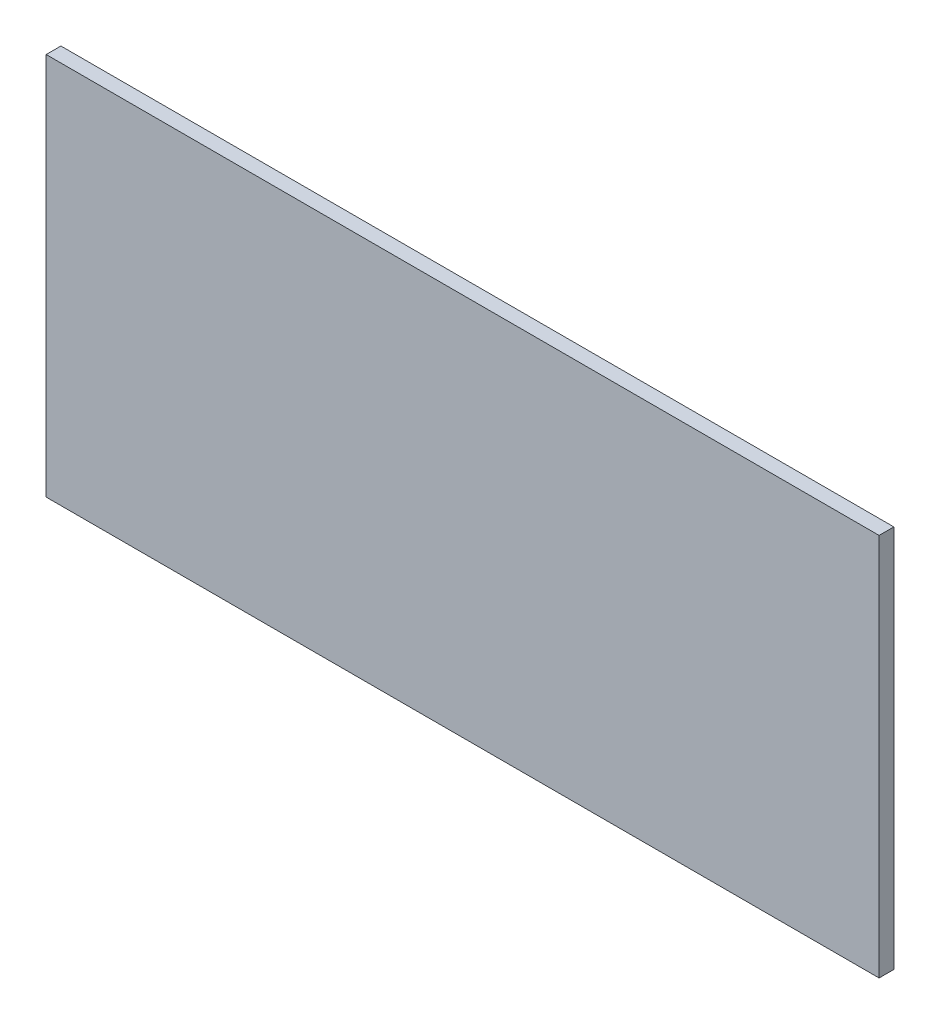
ISO-10303-21;
HEADER;
FILE_DESCRIPTION(('STEP AP214'),'2;1');
FILE_NAME('part.step','',(''),(''),'','','');
FILE_SCHEMA(('AUTOMOTIVE_DESIGN { 1 0 10303 214 1 1 1 1 }'));
ENDSEC;
DATA;
#1=APPLICATION_CONTEXT('core data for automotive mechanical design processes');
#2=APPLICATION_PROTOCOL_DEFINITION('international standard','automotive_design',2000,#1);
#3=PRODUCT_CONTEXT('',#1,'mechanical');
#4=PRODUCT('Part','Part','',(#3));
#5=PRODUCT_RELATED_PRODUCT_CATEGORY('part','',(#4));
#6=PRODUCT_DEFINITION_FORMATION('','',#4);
#7=PRODUCT_DEFINITION_CONTEXT('part definition',#1,'design');
#8=PRODUCT_DEFINITION('design','',#6,#7);
#9=PRODUCT_DEFINITION_SHAPE('','',#8);
#10=(LENGTH_UNIT() NAMED_UNIT(*) SI_UNIT(.MILLI.,.METRE.));
#11=(NAMED_UNIT(*) PLANE_ANGLE_UNIT() SI_UNIT($,.RADIAN.));
#12=(NAMED_UNIT(*) SI_UNIT($,.STERADIAN.) SOLID_ANGLE_UNIT());
#13=UNCERTAINTY_MEASURE_WITH_UNIT(LENGTH_MEASURE(1.E-05),#10,'distance_accuracy_value','');
#14=(GEOMETRIC_REPRESENTATION_CONTEXT(3) GLOBAL_UNCERTAINTY_ASSIGNED_CONTEXT((#13)) GLOBAL_UNIT_ASSIGNED_CONTEXT((#10,
#11,#12)) REPRESENTATION_CONTEXT('',''));
#15=CARTESIAN_POINT('',(0.,0.,0.));
#16=DIRECTION('',(0.,0.,1.));
#17=DIRECTION('',(1.,0.,0.));
#18=AXIS2_PLACEMENT_3D('',#15,#16,#17);
#19=CARTESIAN_POINT('',(-2.825,-1.3,0.1));
#20=DIRECTION('',(0.,0.,-1.));
#21=DIRECTION('',(-1.,0.,0.));
#22=AXIS2_PLACEMENT_3D('',#19,#20,#21);
#23=PLANE('',#22);
#24=DIRECTION('',(0.,1.,0.));
#25=VECTOR('',#24,1.);
#26=CARTESIAN_POINT('',(2.825,-1.3,0.1));
#27=LINE('',#26,#25);
#28=CARTESIAN_POINT('',(2.825,-1.3,0.1));
#29=VERTEX_POINT('',#28);
#30=CARTESIAN_POINT('',(2.825,1.3,0.1));
#31=VERTEX_POINT('',#30);
#32=EDGE_CURVE('E55',#29,#31,#27,.T.);
#33=ORIENTED_EDGE('',*,*,#32,.T.);
#34=DIRECTION('',(1.,0.,0.));
#35=VECTOR('',#34,1.);
#36=CARTESIAN_POINT('',(2.825,1.3,0.1));
#37=LINE('',#36,#35);
#38=CARTESIAN_POINT('',(-2.825,1.3,0.1));
#39=VERTEX_POINT('',#38);
#40=EDGE_CURVE('E57',#31,#39,#37,.F.);
#41=ORIENTED_EDGE('',*,*,#40,.T.);
#42=DIRECTION('',(0.,1.,0.));
#43=VECTOR('',#42,1.);
#44=CARTESIAN_POINT('',(-2.825,1.3,0.1));
#45=LINE('',#44,#43);
#46=CARTESIAN_POINT('',(-2.825,-1.3,0.1));
#47=VERTEX_POINT('',#46);
#48=EDGE_CURVE('E20',#39,#47,#45,.F.);
#49=ORIENTED_EDGE('',*,*,#48,.T.);
#50=DIRECTION('',(1.,0.,0.));
#51=VECTOR('',#50,1.);
#52=CARTESIAN_POINT('',(-2.825,-1.3,0.1));
#53=LINE('',#52,#51);
#54=EDGE_CURVE('E80',#47,#29,#53,.T.);
#55=ORIENTED_EDGE('',*,*,#54,.T.);
#56=EDGE_LOOP('',(#33,#41,#49,#55));
#57=FACE_BOUND('',#56,.T.);
#58=ADVANCED_FACE('F17',(#57),#23,.F.);
#59=CARTESIAN_POINT('',(-2.825,1.3,0.));
#60=DIRECTION('',(1.,0.,0.));
#61=DIRECTION('',(0.,0.,-1.));
#62=AXIS2_PLACEMENT_3D('',#59,#60,#61);
#63=PLANE('',#62);
#64=DIRECTION('',(0.,0.,1.));
#65=VECTOR('',#64,1.);
#66=CARTESIAN_POINT('',(-2.825,-1.3,0.));
#67=LINE('',#66,#65);
#68=CARTESIAN_POINT('',(-2.825,-1.3,0.));
#69=VERTEX_POINT('',#68);
#70=EDGE_CURVE('E68',#69,#47,#67,.T.);
#71=ORIENTED_EDGE('',*,*,#70,.T.);
#72=ORIENTED_EDGE('',*,*,#48,.F.);
#73=DIRECTION('',(0.,0.,-1.));
#74=VECTOR('',#73,1.);
#75=CARTESIAN_POINT('',(-2.825,1.3,0.));
#76=LINE('',#75,#74);
#77=CARTESIAN_POINT('',(-2.825,1.3,0.));
#78=VERTEX_POINT('',#77);
#79=EDGE_CURVE('E63',#39,#78,#76,.T.);
#80=ORIENTED_EDGE('',*,*,#79,.T.);
#81=DIRECTION('',(0.,1.,0.));
#82=VECTOR('',#81,1.);
#83=CARTESIAN_POINT('',(-2.825,-1.3,0.));
#84=LINE('',#83,#82);
#85=EDGE_CURVE('E83',#69,#78,#84,.T.);
#86=ORIENTED_EDGE('',*,*,#85,.F.);
#87=EDGE_LOOP('',(#71,#72,#80,#86));
#88=FACE_BOUND('',#87,.T.);
#89=ADVANCED_FACE('F65',(#88),#63,.F.);
#90=CARTESIAN_POINT('',(2.825,1.3,0.));
#91=DIRECTION('',(0.,-1.,0.));
#92=DIRECTION('',(0.,0.,-1.));
#93=AXIS2_PLACEMENT_3D('',#90,#91,#92);
#94=PLANE('',#93);
#95=ORIENTED_EDGE('',*,*,#79,.F.);
#96=ORIENTED_EDGE('',*,*,#40,.F.);
#97=DIRECTION('',(0.,0.,1.));
#98=VECTOR('',#97,1.);
#99=CARTESIAN_POINT('',(2.825,1.3,0.));
#100=LINE('',#99,#98);
#101=CARTESIAN_POINT('',(2.825,1.3,0.));
#102=VERTEX_POINT('',#101);
#103=EDGE_CURVE('E75',#31,#102,#100,.F.);
#104=ORIENTED_EDGE('',*,*,#103,.T.);
#105=DIRECTION('',(-1.,0.,0.));
#106=VECTOR('',#105,1.);
#107=CARTESIAN_POINT('',(-2.825,1.3,0.));
#108=LINE('',#107,#106);
#109=EDGE_CURVE('E72',#78,#102,#108,.F.);
#110=ORIENTED_EDGE('',*,*,#109,.F.);
#111=EDGE_LOOP('',(#95,#96,#104,#110));
#112=FACE_BOUND('',#111,.T.);
#113=ADVANCED_FACE('F70',(#112),#94,.F.);
#114=CARTESIAN_POINT('',(2.825,-1.3,0.));
#115=DIRECTION('',(-1.,0.,0.));
#116=DIRECTION('',(0.,0.,1.));
#117=AXIS2_PLACEMENT_3D('',#114,#115,#116);
#118=PLANE('',#117);
#119=ORIENTED_EDGE('',*,*,#103,.F.);
#120=ORIENTED_EDGE('',*,*,#32,.F.);
#121=DIRECTION('',(0.,0.,1.));
#122=VECTOR('',#121,1.);
#123=CARTESIAN_POINT('',(2.825,-1.3,0.));
#124=LINE('',#123,#122);
#125=CARTESIAN_POINT('',(2.825,-1.3,0.));
#126=VERTEX_POINT('',#125);
#127=EDGE_CURVE('E35',#29,#126,#124,.F.);
#128=ORIENTED_EDGE('',*,*,#127,.T.);
#129=DIRECTION('',(0.,1.,0.));
#130=VECTOR('',#129,1.);
#131=CARTESIAN_POINT('',(2.825,-1.3,0.));
#132=LINE('',#131,#130);
#133=EDGE_CURVE('E26',#102,#126,#132,.F.);
#134=ORIENTED_EDGE('',*,*,#133,.F.);
#135=EDGE_LOOP('',(#119,#120,#128,#134));
#136=FACE_BOUND('',#135,.T.);
#137=ADVANCED_FACE('F89',(#136),#118,.F.);
#138=CARTESIAN_POINT('',(-2.825,-1.3,0.));
#139=DIRECTION('',(0.,1.,0.));
#140=DIRECTION('',(0.,0.,1.));
#141=AXIS2_PLACEMENT_3D('',#138,#139,#140);
#142=PLANE('',#141);
#143=ORIENTED_EDGE('',*,*,#127,.F.);
#144=ORIENTED_EDGE('',*,*,#54,.F.);
#145=ORIENTED_EDGE('',*,*,#70,.F.);
#146=DIRECTION('',(-1.,0.,0.));
#147=VECTOR('',#146,1.);
#148=CARTESIAN_POINT('',(-2.825,-1.3,0.));
#149=LINE('',#148,#147);
#150=EDGE_CURVE('E11',#126,#69,#149,.T.);
#151=ORIENTED_EDGE('',*,*,#150,.F.);
#152=EDGE_LOOP('',(#143,#144,#145,#151));
#153=FACE_BOUND('',#152,.T.);
#154=ADVANCED_FACE('F91',(#153),#142,.F.);
#155=CARTESIAN_POINT('',(-2.825,-1.3,0.));
#156=DIRECTION('',(0.,0.,-1.));
#157=DIRECTION('',(-1.,0.,0.));
#158=AXIS2_PLACEMENT_3D('',#155,#156,#157);
#159=PLANE('',#158);
#160=ORIENTED_EDGE('',*,*,#133,.T.);
#161=ORIENTED_EDGE('',*,*,#150,.T.);
#162=ORIENTED_EDGE('',*,*,#85,.T.);
#163=ORIENTED_EDGE('',*,*,#109,.T.);
#164=EDGE_LOOP('',(#160,#161,#162,#163));
#165=FACE_BOUND('',#164,.T.);
#166=ADVANCED_FACE('F88',(#165),#159,.T.);
#167=CLOSED_SHELL('',(#58,#89,#113,#137,#154,#166));
#168=MANIFOLD_SOLID_BREP('B1',#167);
#169=ADVANCED_BREP_SHAPE_REPRESENTATION('',(#18,#168),#14);
#170=SHAPE_DEFINITION_REPRESENTATION(#9,#169);
ENDSEC;
END-ISO-10303-21;
